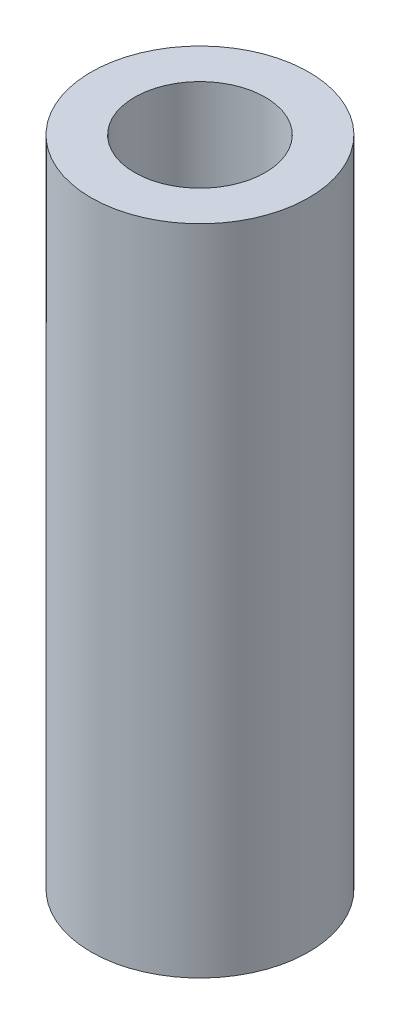
ISO-10303-21;
HEADER;
FILE_DESCRIPTION(('STEP AP214'),'2;1');
FILE_NAME('part.step','',(''),(''),'','','');
FILE_SCHEMA(('AUTOMOTIVE_DESIGN { 1 0 10303 214 1 1 1 1 }'));
ENDSEC;
DATA;
#1=APPLICATION_CONTEXT('core data for automotive mechanical design processes');
#2=APPLICATION_PROTOCOL_DEFINITION('international standard','automotive_design',2000,#1);
#3=PRODUCT_CONTEXT('',#1,'mechanical');
#4=PRODUCT('Part','Part','',(#3));
#5=PRODUCT_RELATED_PRODUCT_CATEGORY('part','',(#4));
#6=PRODUCT_DEFINITION_FORMATION('','',#4);
#7=PRODUCT_DEFINITION_CONTEXT('part definition',#1,'design');
#8=PRODUCT_DEFINITION('design','',#6,#7);
#9=PRODUCT_DEFINITION_SHAPE('','',#8);
#10=(LENGTH_UNIT() NAMED_UNIT(*) SI_UNIT(.MILLI.,.METRE.));
#11=(NAMED_UNIT(*) PLANE_ANGLE_UNIT() SI_UNIT($,.RADIAN.));
#12=(NAMED_UNIT(*) SI_UNIT($,.STERADIAN.) SOLID_ANGLE_UNIT());
#13=UNCERTAINTY_MEASURE_WITH_UNIT(LENGTH_MEASURE(1.E-05),#10,'distance_accuracy_value','');
#14=(GEOMETRIC_REPRESENTATION_CONTEXT(3) GLOBAL_UNCERTAINTY_ASSIGNED_CONTEXT((#13)) GLOBAL_UNIT_ASSIGNED_CONTEXT((#10,
#11,#12)) REPRESENTATION_CONTEXT('',''));
#15=CARTESIAN_POINT('',(0.,0.,0.));
#16=DIRECTION('',(0.,0.,1.));
#17=DIRECTION('',(1.,0.,0.));
#18=AXIS2_PLACEMENT_3D('',#15,#16,#17);
#19=CARTESIAN_POINT('',(0.,15.,0.));
#20=DIRECTION('',(0.,1.,0.));
#21=DIRECTION('',(0.,0.,1.));
#22=AXIS2_PLACEMENT_3D('',#19,#20,#21);
#23=PLANE('',#22);
#24=CARTESIAN_POINT('',(0.,15.,0.));
#25=DIRECTION('',(0.,1.,0.));
#26=DIRECTION('',(0.,0.,1.));
#27=AXIS2_PLACEMENT_3D('',#24,#25,#26);
#28=CIRCLE('',#27,2.5);
#29=CARTESIAN_POINT('',(0.,15.,2.5));
#30=VERTEX_POINT('',#29);
#31=EDGE_CURVE('E10',#30,#30,#28,.T.);
#32=ORIENTED_EDGE('',*,*,#31,.T.);
#33=EDGE_LOOP('',(#32));
#34=FACE_BOUND('',#33,.T.);
#35=CARTESIAN_POINT('',(0.,15.,0.));
#36=DIRECTION('',(0.,1.,0.));
#37=DIRECTION('',(0.,0.,1.));
#38=AXIS2_PLACEMENT_3D('',#35,#36,#37);
#39=CIRCLE('',#38,1.5);
#40=CARTESIAN_POINT('',(0.,15.,1.5));
#41=VERTEX_POINT('',#40);
#42=EDGE_CURVE('E41',#41,#41,#39,.T.);
#43=ORIENTED_EDGE('',*,*,#42,.F.);
#44=EDGE_LOOP('',(#43));
#45=FACE_BOUND('',#44,.T.);
#46=ADVANCED_FACE('F30',(#34,#45),#23,.T.);
#47=CARTESIAN_POINT('',(0.,0.,0.));
#48=DIRECTION('',(0.,1.,0.));
#49=DIRECTION('',(0.,0.,1.));
#50=AXIS2_PLACEMENT_3D('',#47,#48,#49);
#51=PLANE('',#50);
#52=CARTESIAN_POINT('',(0.,0.,0.));
#53=DIRECTION('',(0.,1.,0.));
#54=DIRECTION('',(0.,0.,1.));
#55=AXIS2_PLACEMENT_3D('',#52,#53,#54);
#56=CIRCLE('',#55,2.5);
#57=CARTESIAN_POINT('',(0.,0.,2.5));
#58=VERTEX_POINT('',#57);
#59=EDGE_CURVE('E34',#58,#58,#56,.T.);
#60=ORIENTED_EDGE('',*,*,#59,.F.);
#61=EDGE_LOOP('',(#60));
#62=FACE_BOUND('',#61,.T.);
#63=CARTESIAN_POINT('',(0.,0.,0.));
#64=DIRECTION('',(0.,1.,0.));
#65=DIRECTION('',(0.,0.,1.));
#66=AXIS2_PLACEMENT_3D('',#63,#64,#65);
#67=CIRCLE('',#66,1.5);
#68=CARTESIAN_POINT('',(0.,0.,1.5));
#69=VERTEX_POINT('',#68);
#70=EDGE_CURVE('E43',#69,#69,#67,.T.);
#71=ORIENTED_EDGE('',*,*,#70,.T.);
#72=EDGE_LOOP('',(#71));
#73=FACE_BOUND('',#72,.T.);
#74=ADVANCED_FACE('F53',(#62,#73),#51,.F.);
#75=CARTESIAN_POINT('',(0.,15.,0.));
#76=DIRECTION('',(0.,-1.,0.));
#77=DIRECTION('',(0.,0.,-1.));
#78=AXIS2_PLACEMENT_3D('',#75,#76,#77);
#79=CYLINDRICAL_SURFACE('',#78,2.5);
#80=ORIENTED_EDGE('',*,*,#31,.F.);
#81=EDGE_LOOP('',(#80));
#82=FACE_BOUND('',#81,.T.);
#83=ORIENTED_EDGE('',*,*,#59,.T.);
#84=EDGE_LOOP('',(#83));
#85=FACE_BOUND('',#84,.T.);
#86=ADVANCED_FACE('F32',(#82,#85),#79,.T.);
#87=CARTESIAN_POINT('',(0.,15.,0.));
#88=DIRECTION('',(0.,-1.,0.));
#89=DIRECTION('',(0.,0.,-1.));
#90=AXIS2_PLACEMENT_3D('',#87,#88,#89);
#91=CYLINDRICAL_SURFACE('',#90,1.5);
#92=ORIENTED_EDGE('',*,*,#42,.T.);
#93=EDGE_LOOP('',(#92));
#94=FACE_BOUND('',#93,.T.);
#95=ORIENTED_EDGE('',*,*,#70,.F.);
#96=EDGE_LOOP('',(#95));
#97=FACE_BOUND('',#96,.T.);
#98=ADVANCED_FACE('F49',(#94,#97),#91,.F.);
#99=CLOSED_SHELL('',(#46,#74,#86,#98));
#100=MANIFOLD_SOLID_BREP('B2',#99);
#101=ADVANCED_BREP_SHAPE_REPRESENTATION('',(#18,#100),#14);
#102=SHAPE_DEFINITION_REPRESENTATION(#9,#101);
ENDSEC;
END-ISO-10303-21;
